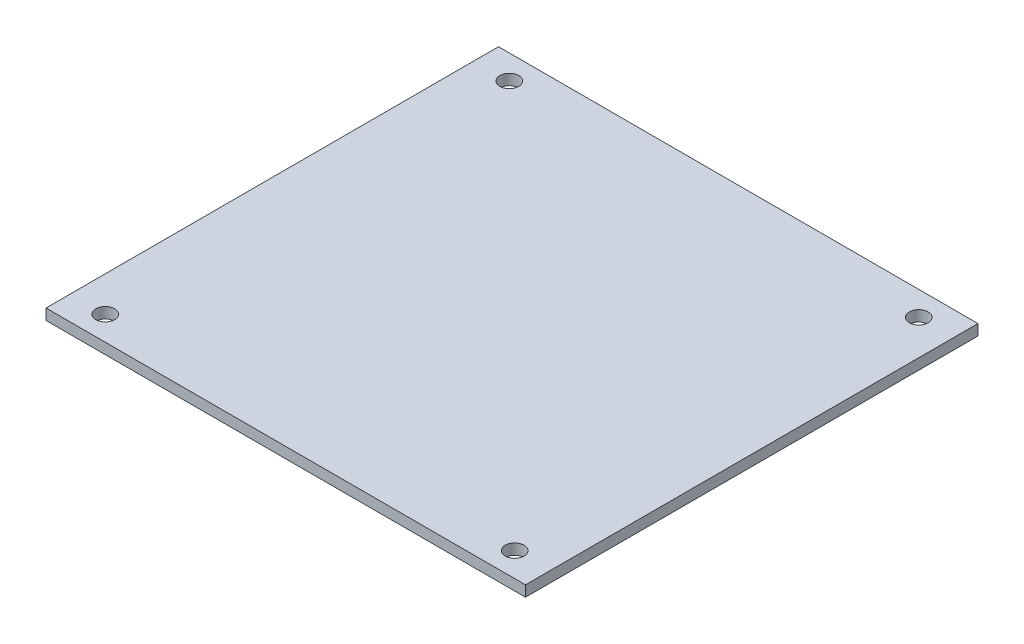
ISO-10303-21;
HEADER;
FILE_DESCRIPTION(('STEP AP214'),'2;1');
FILE_NAME('part.step','',(''),(''),'','','');
FILE_SCHEMA(('AUTOMOTIVE_DESIGN { 1 0 10303 214 1 1 1 1 }'));
ENDSEC;
DATA;
#1=APPLICATION_CONTEXT('core data for automotive mechanical design processes');
#2=APPLICATION_PROTOCOL_DEFINITION('international standard','automotive_design',2000,#1);
#3=PRODUCT_CONTEXT('',#1,'mechanical');
#4=PRODUCT('Part','Part','',(#3));
#5=PRODUCT_RELATED_PRODUCT_CATEGORY('part','',(#4));
#6=PRODUCT_DEFINITION_FORMATION('','',#4);
#7=PRODUCT_DEFINITION_CONTEXT('part definition',#1,'design');
#8=PRODUCT_DEFINITION('design','',#6,#7);
#9=PRODUCT_DEFINITION_SHAPE('','',#8);
#10=(LENGTH_UNIT() NAMED_UNIT(*) SI_UNIT(.MILLI.,.METRE.));
#11=(NAMED_UNIT(*) PLANE_ANGLE_UNIT() SI_UNIT($,.RADIAN.));
#12=(NAMED_UNIT(*) SI_UNIT($,.STERADIAN.) SOLID_ANGLE_UNIT());
#13=UNCERTAINTY_MEASURE_WITH_UNIT(LENGTH_MEASURE(1.E-05),#10,'distance_accuracy_value','');
#14=(GEOMETRIC_REPRESENTATION_CONTEXT(3) GLOBAL_UNCERTAINTY_ASSIGNED_CONTEXT((#13)) GLOBAL_UNIT_ASSIGNED_CONTEXT((#10,
#11,#12)) REPRESENTATION_CONTEXT('',''));
#15=CARTESIAN_POINT('',(0.,0.,0.));
#16=DIRECTION('',(0.,0.,1.));
#17=DIRECTION('',(1.,0.,0.));
#18=AXIS2_PLACEMENT_3D('',#15,#16,#17);
#19=CARTESIAN_POINT('',(-44.5,2.,-42.));
#20=DIRECTION('',(1.,0.,0.));
#21=DIRECTION('',(0.,0.,-1.));
#22=AXIS2_PLACEMENT_3D('',#19,#20,#21);
#23=PLANE('',#22);
#24=DIRECTION('',(0.,0.,1.));
#25=VECTOR('',#24,1.);
#26=CARTESIAN_POINT('',(-44.5,0.,-42.));
#27=LINE('',#26,#25);
#28=CARTESIAN_POINT('',(-44.5,0.,-42.));
#29=VERTEX_POINT('',#28);
#30=CARTESIAN_POINT('',(-44.5,0.,42.));
#31=VERTEX_POINT('',#30);
#32=EDGE_CURVE('E96',#29,#31,#27,.T.);
#33=ORIENTED_EDGE('',*,*,#32,.T.);
#34=DIRECTION('',(0.,-1.,0.));
#35=VECTOR('',#34,1.);
#36=CARTESIAN_POINT('',(-44.5,2.,42.));
#37=LINE('',#36,#35);
#38=CARTESIAN_POINT('',(-44.5,2.,42.));
#39=VERTEX_POINT('',#38);
#40=EDGE_CURVE('E11',#39,#31,#37,.T.);
#41=ORIENTED_EDGE('',*,*,#40,.F.);
#42=DIRECTION('',(0.,0.,1.));
#43=VECTOR('',#42,1.);
#44=CARTESIAN_POINT('',(-44.5,2.,-42.));
#45=LINE('',#44,#43);
#46=CARTESIAN_POINT('',(-44.5,2.,-42.));
#47=VERTEX_POINT('',#46);
#48=EDGE_CURVE('E84',#47,#39,#45,.T.);
#49=ORIENTED_EDGE('',*,*,#48,.F.);
#50=DIRECTION('',(0.,-1.,0.));
#51=VECTOR('',#50,1.);
#52=CARTESIAN_POINT('',(-44.5,2.,-42.));
#53=LINE('',#52,#51);
#54=EDGE_CURVE('E92',#47,#29,#53,.T.);
#55=ORIENTED_EDGE('',*,*,#54,.T.);
#56=EDGE_LOOP('',(#33,#41,#49,#55));
#57=FACE_BOUND('',#56,.T.);
#58=ADVANCED_FACE('F33',(#57),#23,.F.);
#59=CARTESIAN_POINT('',(44.5,2.,42.));
#60=DIRECTION('',(0.,0.,-1.));
#61=DIRECTION('',(-1.,0.,0.));
#62=AXIS2_PLACEMENT_3D('',#59,#60,#61);
#63=PLANE('',#62);
#64=DIRECTION('',(1.,0.,0.));
#65=VECTOR('',#64,1.);
#66=CARTESIAN_POINT('',(44.5,0.,42.));
#67=LINE('',#66,#65);
#68=CARTESIAN_POINT('',(44.5,0.,42.));
#69=VERTEX_POINT('',#68);
#70=EDGE_CURVE('E88',#31,#69,#67,.T.);
#71=ORIENTED_EDGE('',*,*,#70,.T.);
#72=DIRECTION('',(0.,-1.,0.));
#73=VECTOR('',#72,1.);
#74=CARTESIAN_POINT('',(44.5,2.,42.));
#75=LINE('',#74,#73);
#76=CARTESIAN_POINT('',(44.5,2.,42.));
#77=VERTEX_POINT('',#76);
#78=EDGE_CURVE('E41',#77,#69,#75,.T.);
#79=ORIENTED_EDGE('',*,*,#78,.F.);
#80=DIRECTION('',(1.,0.,0.));
#81=VECTOR('',#80,1.);
#82=CARTESIAN_POINT('',(44.5,2.,42.));
#83=LINE('',#82,#81);
#84=EDGE_CURVE('E79',#39,#77,#83,.T.);
#85=ORIENTED_EDGE('',*,*,#84,.F.);
#86=ORIENTED_EDGE('',*,*,#40,.T.);
#87=EDGE_LOOP('',(#71,#79,#85,#86));
#88=FACE_BOUND('',#87,.T.);
#89=ADVANCED_FACE('F87',(#88),#63,.F.);
#90=CARTESIAN_POINT('',(44.5,2.,-42.));
#91=DIRECTION('',(-1.,0.,0.));
#92=DIRECTION('',(0.,0.,1.));
#93=AXIS2_PLACEMENT_3D('',#90,#91,#92);
#94=PLANE('',#93);
#95=DIRECTION('',(0.,0.,-1.));
#96=VECTOR('',#95,1.);
#97=CARTESIAN_POINT('',(44.5,0.,-42.));
#98=LINE('',#97,#96);
#99=CARTESIAN_POINT('',(44.5,0.,-42.));
#100=VERTEX_POINT('',#99);
#101=EDGE_CURVE('E66',#69,#100,#98,.T.);
#102=ORIENTED_EDGE('',*,*,#101,.T.);
#103=DIRECTION('',(0.,-1.,0.));
#104=VECTOR('',#103,1.);
#105=CARTESIAN_POINT('',(44.5,2.,-42.));
#106=LINE('',#105,#104);
#107=CARTESIAN_POINT('',(44.5,2.,-42.));
#108=VERTEX_POINT('',#107);
#109=EDGE_CURVE('E89',#108,#100,#106,.T.);
#110=ORIENTED_EDGE('',*,*,#109,.F.);
#111=DIRECTION('',(0.,0.,-1.));
#112=VECTOR('',#111,1.);
#113=CARTESIAN_POINT('',(44.5,2.,-42.));
#114=LINE('',#113,#112);
#115=EDGE_CURVE('E82',#77,#108,#114,.T.);
#116=ORIENTED_EDGE('',*,*,#115,.F.);
#117=ORIENTED_EDGE('',*,*,#78,.T.);
#118=EDGE_LOOP('',(#102,#110,#116,#117));
#119=FACE_BOUND('',#118,.T.);
#120=ADVANCED_FACE('F90',(#119),#94,.F.);
#121=CARTESIAN_POINT('',(44.5,2.,-42.));
#122=DIRECTION('',(0.,0.,1.));
#123=DIRECTION('',(1.,0.,0.));
#124=AXIS2_PLACEMENT_3D('',#121,#122,#123);
#125=PLANE('',#124);
#126=DIRECTION('',(-1.,0.,0.));
#127=VECTOR('',#126,1.);
#128=CARTESIAN_POINT('',(44.5,0.,-42.));
#129=LINE('',#128,#127);
#130=EDGE_CURVE('E72',#100,#29,#129,.T.);
#131=ORIENTED_EDGE('',*,*,#130,.T.);
#132=ORIENTED_EDGE('',*,*,#54,.F.);
#133=DIRECTION('',(-1.,0.,0.));
#134=VECTOR('',#133,1.);
#135=CARTESIAN_POINT('',(44.5,2.,-42.));
#136=LINE('',#135,#134);
#137=EDGE_CURVE('E49',#108,#47,#136,.T.);
#138=ORIENTED_EDGE('',*,*,#137,.F.);
#139=ORIENTED_EDGE('',*,*,#109,.T.);
#140=EDGE_LOOP('',(#131,#132,#138,#139));
#141=FACE_BOUND('',#140,.T.);
#142=ADVANCED_FACE('F104',(#141),#125,.F.);
#143=CARTESIAN_POINT('',(0.,2.,0.));
#144=DIRECTION('',(0.,-1.,0.));
#145=DIRECTION('',(0.,0.,-1.));
#146=AXIS2_PLACEMENT_3D('',#143,#144,#145);
#147=PLANE('',#146);
#148=CARTESIAN_POINT('',(-38.,2.,-37.5));
#149=DIRECTION('',(0.,-1.,0.));
#150=DIRECTION('',(0.,0.,-1.));
#151=AXIS2_PLACEMENT_3D('',#148,#149,#150);
#152=CIRCLE('',#151,1.75);
#153=CARTESIAN_POINT('',(-38.,2.,-39.25));
#154=VERTEX_POINT('',#153);
#155=EDGE_CURVE('E99',#154,#154,#152,.T.);
#156=ORIENTED_EDGE('',*,*,#155,.T.);
#157=EDGE_LOOP('',(#156));
#158=FACE_BOUND('',#157,.T.);
#159=CARTESIAN_POINT('',(38.,2.,-37.5));
#160=DIRECTION('',(0.,-1.,0.));
#161=DIRECTION('',(0.,0.,-1.));
#162=AXIS2_PLACEMENT_3D('',#159,#160,#161);
#163=CIRCLE('',#162,1.75);
#164=CARTESIAN_POINT('',(38.,2.,-39.25));
#165=VERTEX_POINT('',#164);
#166=EDGE_CURVE('E112',#165,#165,#163,.T.);
#167=ORIENTED_EDGE('',*,*,#166,.T.);
#168=EDGE_LOOP('',(#167));
#169=FACE_BOUND('',#168,.T.);
#170=CARTESIAN_POINT('',(38.,2.,37.5));
#171=DIRECTION('',(0.,-1.,0.));
#172=DIRECTION('',(0.,0.,-1.));
#173=AXIS2_PLACEMENT_3D('',#170,#171,#172);
#174=CIRCLE('',#173,1.75);
#175=CARTESIAN_POINT('',(38.,2.,35.75));
#176=VERTEX_POINT('',#175);
#177=EDGE_CURVE('E115',#176,#176,#174,.T.);
#178=ORIENTED_EDGE('',*,*,#177,.T.);
#179=EDGE_LOOP('',(#178));
#180=FACE_BOUND('',#179,.T.);
#181=CARTESIAN_POINT('',(-38.,2.,37.5));
#182=DIRECTION('',(0.,-1.,0.));
#183=DIRECTION('',(0.,0.,-1.));
#184=AXIS2_PLACEMENT_3D('',#181,#182,#183);
#185=CIRCLE('',#184,1.75);
#186=CARTESIAN_POINT('',(-38.,2.,35.75));
#187=VERTEX_POINT('',#186);
#188=EDGE_CURVE('E118',#187,#187,#185,.T.);
#189=ORIENTED_EDGE('',*,*,#188,.T.);
#190=EDGE_LOOP('',(#189));
#191=FACE_BOUND('',#190,.T.);
#192=ORIENTED_EDGE('',*,*,#48,.T.);
#193=ORIENTED_EDGE('',*,*,#84,.T.);
#194=ORIENTED_EDGE('',*,*,#115,.T.);
#195=ORIENTED_EDGE('',*,*,#137,.T.);
#196=EDGE_LOOP('',(#192,#193,#194,#195));
#197=FACE_BOUND('',#196,.T.);
#198=ADVANCED_FACE('F80',(#158,#169,#180,#191,#197),#147,.F.);
#199=CARTESIAN_POINT('',(0.,0.,0.));
#200=DIRECTION('',(0.,-1.,0.));
#201=DIRECTION('',(0.,0.,-1.));
#202=AXIS2_PLACEMENT_3D('',#199,#200,#201);
#203=PLANE('',#202);
#204=CARTESIAN_POINT('',(-38.,0.,-37.5));
#205=DIRECTION('',(0.,-1.,0.));
#206=DIRECTION('',(0.,0.,-1.));
#207=AXIS2_PLACEMENT_3D('',#204,#205,#206);
#208=CIRCLE('',#207,1.75);
#209=CARTESIAN_POINT('',(-38.,0.,-39.25));
#210=VERTEX_POINT('',#209);
#211=EDGE_CURVE('E125',#210,#210,#208,.T.);
#212=ORIENTED_EDGE('',*,*,#211,.F.);
#213=EDGE_LOOP('',(#212));
#214=FACE_BOUND('',#213,.T.);
#215=CARTESIAN_POINT('',(38.,0.,-37.5));
#216=DIRECTION('',(0.,-1.,0.));
#217=DIRECTION('',(0.,0.,-1.));
#218=AXIS2_PLACEMENT_3D('',#215,#216,#217);
#219=CIRCLE('',#218,1.75);
#220=CARTESIAN_POINT('',(38.,0.,-39.25));
#221=VERTEX_POINT('',#220);
#222=EDGE_CURVE('E128',#221,#221,#219,.T.);
#223=ORIENTED_EDGE('',*,*,#222,.F.);
#224=EDGE_LOOP('',(#223));
#225=FACE_BOUND('',#224,.T.);
#226=CARTESIAN_POINT('',(38.,0.,37.5));
#227=DIRECTION('',(0.,-1.,0.));
#228=DIRECTION('',(0.,0.,-1.));
#229=AXIS2_PLACEMENT_3D('',#226,#227,#228);
#230=CIRCLE('',#229,1.75);
#231=CARTESIAN_POINT('',(38.,0.,35.75));
#232=VERTEX_POINT('',#231);
#233=EDGE_CURVE('E124',#232,#232,#230,.T.);
#234=ORIENTED_EDGE('',*,*,#233,.F.);
#235=EDGE_LOOP('',(#234));
#236=FACE_BOUND('',#235,.T.);
#237=CARTESIAN_POINT('',(-38.,0.,37.5));
#238=DIRECTION('',(0.,-1.,0.));
#239=DIRECTION('',(0.,0.,-1.));
#240=AXIS2_PLACEMENT_3D('',#237,#238,#239);
#241=CIRCLE('',#240,1.75);
#242=CARTESIAN_POINT('',(-38.,0.,35.75));
#243=VERTEX_POINT('',#242);
#244=EDGE_CURVE('E121',#243,#243,#241,.T.);
#245=ORIENTED_EDGE('',*,*,#244,.F.);
#246=EDGE_LOOP('',(#245));
#247=FACE_BOUND('',#246,.T.);
#248=ORIENTED_EDGE('',*,*,#32,.F.);
#249=ORIENTED_EDGE('',*,*,#130,.F.);
#250=ORIENTED_EDGE('',*,*,#101,.F.);
#251=ORIENTED_EDGE('',*,*,#70,.F.);
#252=EDGE_LOOP('',(#248,#249,#250,#251));
#253=FACE_BOUND('',#252,.T.);
#254=ADVANCED_FACE('F107',(#214,#225,#236,#247,#253),#203,.T.);
#255=CARTESIAN_POINT('',(-38.,10.,37.5));
#256=DIRECTION('',(0.,-1.,0.));
#257=DIRECTION('',(0.,0.,-1.));
#258=AXIS2_PLACEMENT_3D('',#255,#256,#257);
#259=CYLINDRICAL_SURFACE('',#258,1.75);
#260=ORIENTED_EDGE('',*,*,#244,.T.);
#261=EDGE_LOOP('',(#260));
#262=FACE_BOUND('',#261,.T.);
#263=ORIENTED_EDGE('',*,*,#188,.F.);
#264=EDGE_LOOP('',(#263));
#265=FACE_BOUND('',#264,.T.);
#266=ADVANCED_FACE('F139',(#262,#265),#259,.F.);
#267=CARTESIAN_POINT('',(38.,10.,37.5));
#268=DIRECTION('',(0.,-1.,0.));
#269=DIRECTION('',(0.,0.,-1.));
#270=AXIS2_PLACEMENT_3D('',#267,#268,#269);
#271=CYLINDRICAL_SURFACE('',#270,1.75);
#272=ORIENTED_EDGE('',*,*,#233,.T.);
#273=EDGE_LOOP('',(#272));
#274=FACE_BOUND('',#273,.T.);
#275=ORIENTED_EDGE('',*,*,#177,.F.);
#276=EDGE_LOOP('',(#275));
#277=FACE_BOUND('',#276,.T.);
#278=ADVANCED_FACE('F134',(#274,#277),#271,.F.);
#279=CARTESIAN_POINT('',(38.,10.,-37.5));
#280=DIRECTION('',(0.,-1.,0.));
#281=DIRECTION('',(0.,0.,-1.));
#282=AXIS2_PLACEMENT_3D('',#279,#280,#281);
#283=CYLINDRICAL_SURFACE('',#282,1.75);
#284=ORIENTED_EDGE('',*,*,#222,.T.);
#285=EDGE_LOOP('',(#284));
#286=FACE_BOUND('',#285,.T.);
#287=ORIENTED_EDGE('',*,*,#166,.F.);
#288=EDGE_LOOP('',(#287));
#289=FACE_BOUND('',#288,.T.);
#290=ADVANCED_FACE('F191',(#286,#289),#283,.F.);
#291=CARTESIAN_POINT('',(-38.,10.,-37.5));
#292=DIRECTION('',(0.,-1.,0.));
#293=DIRECTION('',(0.,0.,-1.));
#294=AXIS2_PLACEMENT_3D('',#291,#292,#293);
#295=CYLINDRICAL_SURFACE('',#294,1.75);
#296=ORIENTED_EDGE('',*,*,#211,.T.);
#297=EDGE_LOOP('',(#296));
#298=FACE_BOUND('',#297,.T.);
#299=ORIENTED_EDGE('',*,*,#155,.F.);
#300=EDGE_LOOP('',(#299));
#301=FACE_BOUND('',#300,.T.);
#302=ADVANCED_FACE('F198',(#298,#301),#295,.F.);
#303=CLOSED_SHELL('',(#58,#89,#120,#142,#198,#254,#266,#278,#290,#302));
#304=MANIFOLD_SOLID_BREP('B2',#303);
#305=ADVANCED_BREP_SHAPE_REPRESENTATION('',(#18,#304),#14);
#306=SHAPE_DEFINITION_REPRESENTATION(#9,#305);
ENDSEC;
END-ISO-10303-21;
